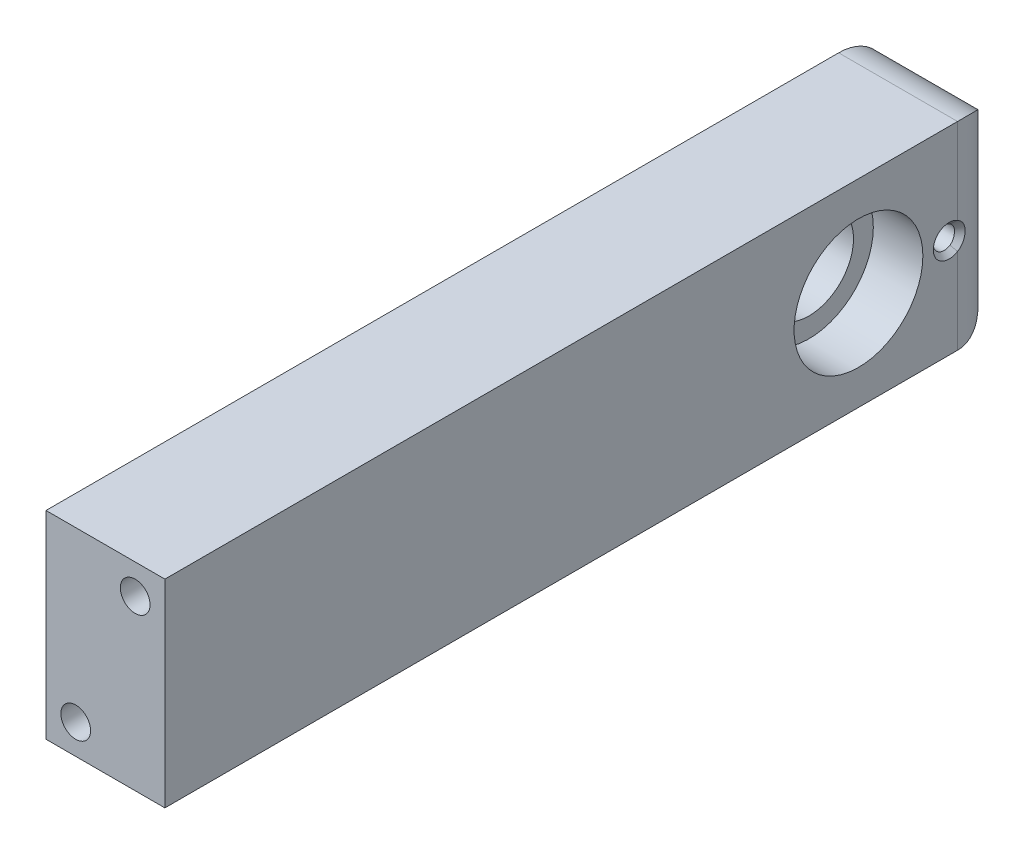
ISO-10303-21;
HEADER;
FILE_DESCRIPTION(('STEP AP214'),'2;1');
FILE_NAME('part.step','',(''),(''),'','','');
FILE_SCHEMA(('AUTOMOTIVE_DESIGN { 1 0 10303 214 1 1 1 1 }'));
ENDSEC;
DATA;
#1=APPLICATION_CONTEXT('core data for automotive mechanical design processes');
#2=APPLICATION_PROTOCOL_DEFINITION('international standard','automotive_design',2000,#1);
#3=PRODUCT_CONTEXT('',#1,'mechanical');
#4=PRODUCT('Part','Part','',(#3));
#5=PRODUCT_RELATED_PRODUCT_CATEGORY('part','',(#4));
#6=PRODUCT_DEFINITION_FORMATION('','',#4);
#7=PRODUCT_DEFINITION_CONTEXT('part definition',#1,'design');
#8=PRODUCT_DEFINITION('design','',#6,#7);
#9=PRODUCT_DEFINITION_SHAPE('','',#8);
#10=(LENGTH_UNIT() NAMED_UNIT(*) SI_UNIT(.MILLI.,.METRE.));
#11=(NAMED_UNIT(*) PLANE_ANGLE_UNIT() SI_UNIT($,.RADIAN.));
#12=(NAMED_UNIT(*) SI_UNIT($,.STERADIAN.) SOLID_ANGLE_UNIT());
#13=UNCERTAINTY_MEASURE_WITH_UNIT(LENGTH_MEASURE(1.E-05),#10,'distance_accuracy_value','');
#14=(GEOMETRIC_REPRESENTATION_CONTEXT(3) GLOBAL_UNCERTAINTY_ASSIGNED_CONTEXT((#13)) GLOBAL_UNIT_ASSIGNED_CONTEXT((#10,
#11,#12)) REPRESENTATION_CONTEXT('',''));
#15=CARTESIAN_POINT('',(0.,0.,0.));
#16=DIRECTION('',(0.,0.,1.));
#17=DIRECTION('',(1.,0.,0.));
#18=AXIS2_PLACEMENT_3D('',#15,#16,#17);
#19=CARTESIAN_POINT('',(6.,-10.,85.));
#20=DIRECTION('',(-1.,0.,0.));
#21=DIRECTION('',(0.,0.,1.));
#22=AXIS2_PLACEMENT_3D('',#19,#20,#21);
#23=PLANE('',#22);
#24=CARTESIAN_POINT('',(6.,0.,15.));
#25=DIRECTION('',(1.,0.,0.));
#26=DIRECTION('',(0.,0.,-1.));
#27=AXIS2_PLACEMENT_3D('',#24,#25,#26);
#28=CIRCLE('',#27,6.5);
#29=CARTESIAN_POINT('',(6.,0.,8.5));
#30=VERTEX_POINT('',#29);
#31=EDGE_CURVE('E142',#30,#30,#28,.T.);
#32=ORIENTED_EDGE('',*,*,#31,.F.);
#33=EDGE_LOOP('',(#32));
#34=FACE_BOUND('',#33,.T.);
#35=DIRECTION('',(0.,1.,0.));
#36=VECTOR('',#35,1.);
#37=CARTESIAN_POINT('',(6.,10.,5.));
#38=LINE('',#37,#36);
#39=CARTESIAN_POINT('',(6.,-10.,5.));
#40=VERTEX_POINT('',#39);
#41=CARTESIAN_POINT('',(6.,-1.35554417117228,5.));
#42=VERTEX_POINT('',#41);
#43=EDGE_CURVE('E162',#40,#42,#38,.T.);
#44=ORIENTED_EDGE('',*,*,#43,.T.);
#45=CARTESIAN_POINT('',(6.,0.,5.85));
#46=DIRECTION('',(-1.,0.,0.));
#47=DIRECTION('',(0.,0.,1.));
#48=AXIS2_PLACEMENT_3D('',#45,#46,#47);
#49=CIRCLE('',#48,1.59999999999974);
#50=CARTESIAN_POINT('',(6.,1.35554417117231,5.));
#51=VERTEX_POINT('',#50);
#52=EDGE_CURVE('E11',#42,#51,#49,.T.);
#53=ORIENTED_EDGE('',*,*,#52,.T.);
#54=CARTESIAN_POINT('',(6.,10.,5.));
#55=VERTEX_POINT('',#54);
#56=EDGE_CURVE('E130',#51,#55,#38,.T.);
#57=ORIENTED_EDGE('',*,*,#56,.T.);
#58=DIRECTION('',(0.,0.,-1.));
#59=VECTOR('',#58,1.);
#60=CARTESIAN_POINT('',(6.,10.,85.));
#61=LINE('',#60,#59);
#62=CARTESIAN_POINT('',(6.,10.,85.));
#63=VERTEX_POINT('',#62);
#64=EDGE_CURVE('E113',#63,#55,#61,.T.);
#65=ORIENTED_EDGE('',*,*,#64,.F.);
#66=DIRECTION('',(0.,1.,0.));
#67=VECTOR('',#66,1.);
#68=CARTESIAN_POINT('',(6.,-10.,85.));
#69=LINE('',#68,#67);
#70=CARTESIAN_POINT('',(6.,-10.,85.));
#71=VERTEX_POINT('',#70);
#72=EDGE_CURVE('E120',#71,#63,#69,.T.);
#73=ORIENTED_EDGE('',*,*,#72,.F.);
#74=DIRECTION('',(0.,0.,-1.));
#75=VECTOR('',#74,1.);
#76=CARTESIAN_POINT('',(6.,-10.,85.));
#77=LINE('',#76,#75);
#78=EDGE_CURVE('E333',#71,#40,#77,.T.);
#79=ORIENTED_EDGE('',*,*,#78,.T.);
#80=EDGE_LOOP('',(#44,#53,#57,#65,#73,#79));
#81=FACE_BOUND('',#80,.T.);
#82=ADVANCED_FACE('F39',(#34,#81),#23,.F.);
#83=CARTESIAN_POINT('',(-6.,10.,85.));
#84=DIRECTION('',(0.,-1.,0.));
#85=DIRECTION('',(0.,0.,-1.));
#86=AXIS2_PLACEMENT_3D('',#83,#84,#85);
#87=PLANE('',#86);
#88=ORIENTED_EDGE('',*,*,#64,.T.);
#89=DIRECTION('',(-1.,0.,0.));
#90=VECTOR('',#89,1.);
#91=CARTESIAN_POINT('',(-6.,10.,5.));
#92=LINE('',#91,#90);
#93=CARTESIAN_POINT('',(-6.,10.,5.));
#94=VERTEX_POINT('',#93);
#95=EDGE_CURVE('E156',#55,#94,#92,.T.);
#96=ORIENTED_EDGE('',*,*,#95,.T.);
#97=DIRECTION('',(0.,0.,-1.));
#98=VECTOR('',#97,1.);
#99=CARTESIAN_POINT('',(-6.,10.,85.));
#100=LINE('',#99,#98);
#101=CARTESIAN_POINT('',(-6.,10.,85.));
#102=VERTEX_POINT('',#101);
#103=EDGE_CURVE('E116',#102,#94,#100,.T.);
#104=ORIENTED_EDGE('',*,*,#103,.F.);
#105=DIRECTION('',(-1.,0.,0.));
#106=VECTOR('',#105,1.);
#107=CARTESIAN_POINT('',(-6.,10.,85.));
#108=LINE('',#107,#106);
#109=EDGE_CURVE('E109',#63,#102,#108,.T.);
#110=ORIENTED_EDGE('',*,*,#109,.F.);
#111=EDGE_LOOP('',(#88,#96,#104,#110));
#112=FACE_BOUND('',#111,.T.);
#113=ADVANCED_FACE('F111',(#112),#87,.F.);
#114=CARTESIAN_POINT('',(-6.,-10.,85.));
#115=DIRECTION('',(1.,0.,0.));
#116=DIRECTION('',(0.,0.,-1.));
#117=AXIS2_PLACEMENT_3D('',#114,#115,#116);
#118=PLANE('',#117);
#119=CARTESIAN_POINT('',(-6.,0.,5.85));
#120=DIRECTION('',(-1.,0.,0.));
#121=DIRECTION('',(0.,0.,1.));
#122=AXIS2_PLACEMENT_3D('',#119,#120,#121);
#123=CIRCLE('',#122,1.09999999999973);
#124=CARTESIAN_POINT('',(-6.,0.,6.94999999999973));
#125=VERTEX_POINT('',#124);
#126=EDGE_CURVE('E304',#125,#125,#123,.T.);
#127=ORIENTED_EDGE('',*,*,#126,.F.);
#128=EDGE_LOOP('',(#127));
#129=FACE_BOUND('',#128,.T.);
#130=CARTESIAN_POINT('',(-6.,0.,15.));
#131=DIRECTION('',(-1.,0.,0.));
#132=DIRECTION('',(0.,0.,1.));
#133=AXIS2_PLACEMENT_3D('',#130,#131,#132);
#134=CIRCLE('',#133,4.5);
#135=CARTESIAN_POINT('',(-6.,0.,19.5));
#136=VERTEX_POINT('',#135);
#137=EDGE_CURVE('E143',#136,#136,#134,.T.);
#138=ORIENTED_EDGE('',*,*,#137,.F.);
#139=EDGE_LOOP('',(#138));
#140=FACE_BOUND('',#139,.T.);
#141=DIRECTION('',(0.,-1.,0.));
#142=VECTOR('',#141,1.);
#143=CARTESIAN_POINT('',(-6.,-10.,0.));
#144=LINE('',#143,#142);
#145=CARTESIAN_POINT('',(-6.,5.,0.));
#146=VERTEX_POINT('',#145);
#147=CARTESIAN_POINT('',(-6.,-5.,0.));
#148=VERTEX_POINT('',#147);
#149=EDGE_CURVE('E128',#146,#148,#144,.T.);
#150=ORIENTED_EDGE('',*,*,#149,.T.);
#151=CARTESIAN_POINT('',(-6.,-5.,5.));
#152=DIRECTION('',(1.,0.,0.));
#153=DIRECTION('',(0.,0.,-1.));
#154=AXIS2_PLACEMENT_3D('',#151,#152,#153);
#155=CIRCLE('',#154,5.);
#156=CARTESIAN_POINT('',(-6.,-10.,5.));
#157=VERTEX_POINT('',#156);
#158=EDGE_CURVE('E152',#148,#157,#155,.F.);
#159=ORIENTED_EDGE('',*,*,#158,.T.);
#160=DIRECTION('',(0.,0.,-1.));
#161=VECTOR('',#160,1.);
#162=CARTESIAN_POINT('',(-6.,-10.,85.));
#163=LINE('',#162,#161);
#164=CARTESIAN_POINT('',(-6.,-10.,85.));
#165=VERTEX_POINT('',#164);
#166=EDGE_CURVE('E136',#165,#157,#163,.T.);
#167=ORIENTED_EDGE('',*,*,#166,.F.);
#168=DIRECTION('',(0.,-1.,0.));
#169=VECTOR('',#168,1.);
#170=CARTESIAN_POINT('',(-6.,-10.,85.));
#171=LINE('',#170,#169);
#172=EDGE_CURVE('E119',#102,#165,#171,.T.);
#173=ORIENTED_EDGE('',*,*,#172,.F.);
#174=ORIENTED_EDGE('',*,*,#103,.T.);
#175=CARTESIAN_POINT('',(-6.,5.,5.));
#176=DIRECTION('',(1.,0.,0.));
#177=DIRECTION('',(0.,0.,-1.));
#178=AXIS2_PLACEMENT_3D('',#175,#176,#177);
#179=CIRCLE('',#178,5.);
#180=EDGE_CURVE('E150',#94,#146,#179,.F.);
#181=ORIENTED_EDGE('',*,*,#180,.T.);
#182=EDGE_LOOP('',(#150,#159,#167,#173,#174,#181));
#183=FACE_BOUND('',#182,.T.);
#184=ADVANCED_FACE('F225',(#129,#140,#183),#118,.F.);
#185=CARTESIAN_POINT('',(-6.,-10.,85.));
#186=DIRECTION('',(0.,1.,0.));
#187=DIRECTION('',(0.,0.,1.));
#188=AXIS2_PLACEMENT_3D('',#185,#186,#187);
#189=PLANE('',#188);
#190=ORIENTED_EDGE('',*,*,#166,.T.);
#191=DIRECTION('',(1.,0.,0.));
#192=VECTOR('',#191,1.);
#193=CARTESIAN_POINT('',(6.,-10.,5.));
#194=LINE('',#193,#192);
#195=EDGE_CURVE('E131',#157,#40,#194,.T.);
#196=ORIENTED_EDGE('',*,*,#195,.T.);
#197=ORIENTED_EDGE('',*,*,#78,.F.);
#198=DIRECTION('',(1.,0.,0.));
#199=VECTOR('',#198,1.);
#200=CARTESIAN_POINT('',(-6.,-10.,85.));
#201=LINE('',#200,#199);
#202=EDGE_CURVE('E125',#165,#71,#201,.T.);
#203=ORIENTED_EDGE('',*,*,#202,.F.);
#204=EDGE_LOOP('',(#190,#196,#197,#203));
#205=FACE_BOUND('',#204,.T.);
#206=ADVANCED_FACE('F218',(#205),#189,.F.);
#207=CARTESIAN_POINT('',(0.,0.,85.));
#208=DIRECTION('',(0.,0.,-1.));
#209=DIRECTION('',(-1.,0.,0.));
#210=AXIS2_PLACEMENT_3D('',#207,#208,#209);
#211=PLANE('',#210);
#212=CARTESIAN_POINT('',(3.,7.,85.));
#213=DIRECTION('',(0.,0.,1.));
#214=DIRECTION('',(1.,0.,0.));
#215=AXIS2_PLACEMENT_3D('',#212,#213,#214);
#216=CIRCLE('',#215,1.5);
#217=CARTESIAN_POINT('',(4.5,7.,85.));
#218=VERTEX_POINT('',#217);
#219=EDGE_CURVE('E323',#218,#218,#216,.T.);
#220=ORIENTED_EDGE('',*,*,#219,.F.);
#221=EDGE_LOOP('',(#220));
#222=FACE_BOUND('',#221,.T.);
#223=CARTESIAN_POINT('',(-3.,-7.,85.));
#224=DIRECTION('',(0.,0.,1.));
#225=DIRECTION('',(1.,0.,0.));
#226=AXIS2_PLACEMENT_3D('',#223,#224,#225);
#227=CIRCLE('',#226,1.5);
#228=CARTESIAN_POINT('',(-1.5,-7.,85.));
#229=VERTEX_POINT('',#228);
#230=EDGE_CURVE('E317',#229,#229,#227,.T.);
#231=ORIENTED_EDGE('',*,*,#230,.F.);
#232=EDGE_LOOP('',(#231));
#233=FACE_BOUND('',#232,.T.);
#234=ORIENTED_EDGE('',*,*,#72,.T.);
#235=ORIENTED_EDGE('',*,*,#109,.T.);
#236=ORIENTED_EDGE('',*,*,#172,.T.);
#237=ORIENTED_EDGE('',*,*,#202,.T.);
#238=EDGE_LOOP('',(#234,#235,#236,#237));
#239=FACE_BOUND('',#238,.T.);
#240=ADVANCED_FACE('F123',(#222,#233,#239),#211,.F.);
#241=CARTESIAN_POINT('',(0.,0.,0.));
#242=DIRECTION('',(0.,0.,-1.));
#243=DIRECTION('',(-1.,0.,0.));
#244=AXIS2_PLACEMENT_3D('',#241,#242,#243);
#245=PLANE('',#244);
#246=DIRECTION('',(0.,1.,0.));
#247=VECTOR('',#246,1.);
#248=CARTESIAN_POINT('',(0.999999999999998,-10.,0.));
#249=LINE('',#248,#247);
#250=CARTESIAN_POINT('',(0.999999999999998,5.,0.));
#251=VERTEX_POINT('',#250);
#252=CARTESIAN_POINT('',(0.999999999999998,-5.,0.));
#253=VERTEX_POINT('',#252);
#254=EDGE_CURVE('E146',#251,#253,#249,.F.);
#255=ORIENTED_EDGE('',*,*,#254,.T.);
#256=DIRECTION('',(1.,0.,0.));
#257=VECTOR('',#256,1.);
#258=CARTESIAN_POINT('',(-6.,-5.,0.));
#259=LINE('',#258,#257);
#260=EDGE_CURVE('E148',#253,#148,#259,.F.);
#261=ORIENTED_EDGE('',*,*,#260,.T.);
#262=ORIENTED_EDGE('',*,*,#149,.F.);
#263=DIRECTION('',(-1.,0.,0.));
#264=VECTOR('',#263,1.);
#265=CARTESIAN_POINT('',(6.,5.,0.));
#266=LINE('',#265,#264);
#267=EDGE_CURVE('E134',#146,#251,#266,.F.);
#268=ORIENTED_EDGE('',*,*,#267,.T.);
#269=EDGE_LOOP('',(#255,#261,#262,#268));
#270=FACE_BOUND('',#269,.T.);
#271=ADVANCED_FACE('F214',(#270),#245,.T.);
#272=CARTESIAN_POINT('',(-3.,-7.,75.));
#273=DIRECTION('',(0.,0.,1.));
#274=DIRECTION('',(1.,0.,0.));
#275=AXIS2_PLACEMENT_3D('',#272,#273,#274);
#276=CYLINDRICAL_SURFACE('',#275,1.5);
#277=CARTESIAN_POINT('',(-3.,-7.,75.));
#278=DIRECTION('',(0.,0.,1.));
#279=DIRECTION('',(1.,0.,0.));
#280=AXIS2_PLACEMENT_3D('',#277,#278,#279);
#281=CIRCLE('',#280,1.5);
#282=CARTESIAN_POINT('',(-1.5,-7.,75.));
#283=VERTEX_POINT('',#282);
#284=EDGE_CURVE('E326',#283,#283,#281,.T.);
#285=ORIENTED_EDGE('',*,*,#284,.F.);
#286=EDGE_LOOP('',(#285));
#287=FACE_BOUND('',#286,.T.);
#288=ORIENTED_EDGE('',*,*,#230,.T.);
#289=EDGE_LOOP('',(#288));
#290=FACE_BOUND('',#289,.T.);
#291=ADVANCED_FACE('F210',(#287,#290),#276,.F.);
#292=CARTESIAN_POINT('',(-3.,-7.,75.));
#293=DIRECTION('',(0.,0.,1.));
#294=DIRECTION('',(1.,0.,0.));
#295=AXIS2_PLACEMENT_3D('',#292,#293,#294);
#296=PLANE('',#295);
#297=ORIENTED_EDGE('',*,*,#284,.T.);
#298=EDGE_LOOP('',(#297));
#299=FACE_BOUND('',#298,.T.);
#300=ADVANCED_FACE('F206',(#299),#296,.T.);
#301=CARTESIAN_POINT('',(3.,7.,75.));
#302=DIRECTION('',(0.,0.,1.));
#303=DIRECTION('',(1.,0.,0.));
#304=AXIS2_PLACEMENT_3D('',#301,#302,#303);
#305=CYLINDRICAL_SURFACE('',#304,1.5);
#306=CARTESIAN_POINT('',(3.,7.,75.));
#307=DIRECTION('',(0.,0.,1.));
#308=DIRECTION('',(1.,0.,0.));
#309=AXIS2_PLACEMENT_3D('',#306,#307,#308);
#310=CIRCLE('',#309,1.5);
#311=CARTESIAN_POINT('',(4.5,7.,75.));
#312=VERTEX_POINT('',#311);
#313=EDGE_CURVE('E320',#312,#312,#310,.T.);
#314=ORIENTED_EDGE('',*,*,#313,.F.);
#315=EDGE_LOOP('',(#314));
#316=FACE_BOUND('',#315,.T.);
#317=ORIENTED_EDGE('',*,*,#219,.T.);
#318=EDGE_LOOP('',(#317));
#319=FACE_BOUND('',#318,.T.);
#320=ADVANCED_FACE('F202',(#316,#319),#305,.F.);
#321=CARTESIAN_POINT('',(3.,7.,75.));
#322=DIRECTION('',(0.,0.,1.));
#323=DIRECTION('',(1.,0.,0.));
#324=AXIS2_PLACEMENT_3D('',#321,#322,#323);
#325=PLANE('',#324);
#326=ORIENTED_EDGE('',*,*,#313,.T.);
#327=EDGE_LOOP('',(#326));
#328=FACE_BOUND('',#327,.T.);
#329=ADVANCED_FACE('F198',(#328),#325,.T.);
#330=CARTESIAN_POINT('',(0.999999999999998,0.,15.));
#331=DIRECTION('',(1.,0.,0.));
#332=DIRECTION('',(0.,0.,-1.));
#333=AXIS2_PLACEMENT_3D('',#330,#331,#332);
#334=CYLINDRICAL_SURFACE('',#333,6.5);
#335=CARTESIAN_POINT('',(0.999999999999998,0.,15.));
#336=DIRECTION('',(1.,0.,0.));
#337=DIRECTION('',(0.,0.,-1.));
#338=AXIS2_PLACEMENT_3D('',#335,#336,#337);
#339=CIRCLE('',#338,6.5);
#340=CARTESIAN_POINT('',(0.999999999999998,0.,8.5));
#341=VERTEX_POINT('',#340);
#342=EDGE_CURVE('E314',#341,#341,#339,.T.);
#343=ORIENTED_EDGE('',*,*,#342,.F.);
#344=EDGE_LOOP('',(#343));
#345=FACE_BOUND('',#344,.T.);
#346=ORIENTED_EDGE('',*,*,#31,.T.);
#347=EDGE_LOOP('',(#346));
#348=FACE_BOUND('',#347,.T.);
#349=ADVANCED_FACE('F194',(#345,#348),#334,.F.);
#350=CARTESIAN_POINT('',(0.999999999999998,0.,15.));
#351=DIRECTION('',(1.,0.,0.));
#352=DIRECTION('',(0.,0.,-1.));
#353=AXIS2_PLACEMENT_3D('',#350,#351,#352);
#354=PLANE('',#353);
#355=CARTESIAN_POINT('',(0.999999999999998,0.,15.));
#356=DIRECTION('',(1.,0.,0.));
#357=DIRECTION('',(0.,0.,-1.));
#358=AXIS2_PLACEMENT_3D('',#355,#356,#357);
#359=CIRCLE('',#358,4.5);
#360=CARTESIAN_POINT('',(0.999999999999998,0.,10.5));
#361=VERTEX_POINT('',#360);
#362=EDGE_CURVE('E140',#361,#361,#359,.T.);
#363=ORIENTED_EDGE('',*,*,#362,.F.);
#364=EDGE_LOOP('',(#363));
#365=FACE_BOUND('',#364,.T.);
#366=ORIENTED_EDGE('',*,*,#342,.T.);
#367=EDGE_LOOP('',(#366));
#368=FACE_BOUND('',#367,.T.);
#369=ADVANCED_FACE('F190',(#365,#368),#354,.T.);
#370=CARTESIAN_POINT('',(6.,0.,15.));
#371=DIRECTION('',(-1.,0.,0.));
#372=DIRECTION('',(0.,0.,1.));
#373=AXIS2_PLACEMENT_3D('',#370,#371,#372);
#374=CYLINDRICAL_SURFACE('',#373,4.5);
#375=ORIENTED_EDGE('',*,*,#362,.T.);
#376=EDGE_LOOP('',(#375));
#377=FACE_BOUND('',#376,.T.);
#378=ORIENTED_EDGE('',*,*,#137,.T.);
#379=EDGE_LOOP('',(#378));
#380=FACE_BOUND('',#379,.T.);
#381=ADVANCED_FACE('F186',(#377,#380),#374,.F.);
#382=CARTESIAN_POINT('',(-6.,5.,5.));
#383=DIRECTION('',(1.,0.,0.));
#384=DIRECTION('',(0.,0.,-1.));
#385=AXIS2_PLACEMENT_3D('',#382,#383,#384);
#386=CYLINDRICAL_SURFACE('',#385,5.);
#387=ORIENTED_EDGE('',*,*,#180,.F.);
#388=ORIENTED_EDGE('',*,*,#95,.F.);
#389=CARTESIAN_POINT('',(0.999999999999998,5.,5.));
#390=DIRECTION('',(0.707106781186547,-0.707106781186547,0.));
#391=DIRECTION('',(0.707106781186547,0.707106781186547,0.));
#392=AXIS2_PLACEMENT_3D('',#389,#390,#391);
#393=ELLIPSE('',#392,7.07106781186547,5.);
#394=EDGE_CURVE('E310',#251,#55,#393,.T.);
#395=ORIENTED_EDGE('',*,*,#394,.F.);
#396=ORIENTED_EDGE('',*,*,#267,.F.);
#397=EDGE_LOOP('',(#387,#388,#395,#396));
#398=FACE_BOUND('',#397,.T.);
#399=ADVANCED_FACE('F189',(#398),#386,.T.);
#400=CARTESIAN_POINT('',(0.999999999999998,-10.,5.));
#401=DIRECTION('',(0.,-1.,0.));
#402=DIRECTION('',(0.,0.,-1.));
#403=AXIS2_PLACEMENT_3D('',#400,#401,#402);
#404=CYLINDRICAL_SURFACE('',#403,5.);
#405=ORIENTED_EDGE('',*,*,#56,.F.);
#406=CARTESIAN_POINT('',(6.,-1.35554417117228,5.00000000000001));
#407=CARTESIAN_POINT('',(5.99999887546876,-1.31935419357018,4.93588151537443));
#408=CARTESIAN_POINT('',(5.99877171760392,-1.27992329824546,4.87506133053739));
#409=CARTESIAN_POINT('',(5.99561083909648,-1.21610701320761,4.78856333170941));
#410=CARTESIAN_POINT('',(5.99433627601306,-1.19405479132877,4.76052122431837));
#411=CARTESIAN_POINT('',(5.99142414366557,-1.1483945367328,4.70601008795976));
#412=CARTESIAN_POINT('',(5.98978641608421,-1.12478654040462,4.67954102986061));
#413=CARTESIAN_POINT('',(5.98622278073417,-1.07600034352984,4.62818698240978));
#414=CARTESIAN_POINT('',(5.98429595236251,-1.05081190202665,4.60329471001046));
#415=CARTESIAN_POINT('',(5.98023069438661,-0.998871917398047,4.55515392125045));
#416=CARTESIAN_POINT('',(5.97808207806446,-0.97199450267686,4.53181416387674));
#417=CARTESIAN_POINT('',(5.9737110398759,-0.917429886432049,4.48746480661742));
#418=CARTESIAN_POINT('',(5.97147826579394,-0.889608136527665,4.46632158915809));
#419=CARTESIAN_POINT('',(5.96699925330906,-0.832977706869429,4.42612949441239));
#420=CARTESIAN_POINT('',(5.96475189697835,-0.804156437190698,4.40706830441694));
#421=CARTESIAN_POINT('',(5.9580909100551,-0.716181202913144,4.35296297677382));
#422=CARTESIAN_POINT('',(5.95375918012261,-0.655506513210227,4.32098796743099));
#423=CARTESIAN_POINT('',(5.94780411359106,-0.561440737557803,4.27928344497277));
#424=CARTESIAN_POINT('',(5.94590483238953,-0.529466180291179,4.26640176063086));
#425=CARTESIAN_POINT('',(5.94237091578252,-0.464930320411764,4.24295987674977));
#426=CARTESIAN_POINT('',(5.94074417096145,-0.432525332089706,4.23244764723167));
#427=CARTESIAN_POINT('',(5.93780218561286,-0.367314811791007,4.21374352250243));
#428=CARTESIAN_POINT('',(5.93648805547647,-0.334531503289964,4.20555909087693));
#429=CARTESIAN_POINT('',(5.93420525548111,-0.268611562563158,4.1915018706636));
#430=CARTESIAN_POINT('',(5.93323652992647,-0.235474919636769,4.18562916293615));
#431=CARTESIAN_POINT('',(5.93088782392722,-0.135533118507153,4.17148489569106));
#432=CARTESIAN_POINT('',(5.93006750051785,-0.0682275554746119,4.16667267049615));
#433=CARTESIAN_POINT('',(5.93006547318689,0.0679749888351969,4.16666067391239));
#434=CARTESIAN_POINT('',(5.93088528548876,0.135373087888064,4.17146990728449));
#435=CARTESIAN_POINT('',(5.93323208066654,0.235311515249672,4.18560222151105));
#436=CARTESIAN_POINT('',(5.93419998106964,0.268439554816096,4.19146975484492));
#437=CARTESIAN_POINT('',(5.93648028460049,0.334326693305265,4.20551087755209));
#438=CARTESIAN_POINT('',(5.93779274158944,0.367086005473655,4.21368440480746));
#439=CARTESIAN_POINT('',(5.94073014501523,0.432233761469351,4.23235755881328));
#440=CARTESIAN_POINT('',(5.94235528324704,0.464621958798522,4.24285856352954));
#441=CARTESIAN_POINT('',(5.94587925888794,0.529021824853631,4.26622975574313));
#442=CARTESIAN_POINT('',(5.94778304675036,0.561088179081947,4.27913884058593));
#443=CARTESIAN_POINT('',(5.95175401728336,0.623852566736355,4.30694252037483));
#444=CARTESIAN_POINT('',(5.95383140759102,0.654745402420917,4.32190386885589));
#445=CARTESIAN_POINT('',(5.95810146521845,0.715454972413842,4.35386551492998));
#446=CARTESIAN_POINT('',(5.96029528923699,0.745291680700241,4.37087290392672));
#447=CARTESIAN_POINT('',(5.96695508887587,0.833263035458151,4.42495552510601));
#448=CARTESIAN_POINT('',(5.97150255996019,0.8898641920768,4.46508693301575));
#449=CARTESIAN_POINT('',(5.9769623973196,0.958016471767514,4.52044628459099));
#450=CARTESIAN_POINT('',(5.97804269536191,0.971515886234897,4.53178384920035));
#451=CARTESIAN_POINT('',(5.98017052902915,0.998251670288542,4.55498596209424));
#452=CARTESIAN_POINT('',(5.98121831064939,1.01149286447863,4.56685898319495));
#453=CARTESIAN_POINT('',(5.98427530472768,1.05054297456702,4.60303122700905));
#454=CARTESIAN_POINT('',(5.98620502166585,1.07576371169769,4.62794674963142));
#455=CARTESIAN_POINT('',(5.98977511624149,1.12462540953108,4.67936263539093));
#456=CARTESIAN_POINT('',(5.99141546415606,1.148264754939,4.70586037876757));
#457=CARTESIAN_POINT('',(5.99433169334122,1.19397666069143,4.76042274260202));
#458=CARTESIAN_POINT('',(5.99560773185176,1.21604917499952,4.78848740158613));
#459=CARTESIAN_POINT('',(5.99877164831428,1.27991213185126,4.87504127230071));
#460=CARTESIAN_POINT('',(5.99999890395832,1.31935513770023,4.93588314242297));
#461=CARTESIAN_POINT('',(6.,1.35554417117231,5.));
#462=B_SPLINE_CURVE_WITH_KNOTS('',3,(#406,#407,#408,#409,#410,#411,#412,#413,#414,#415,#416,
#417,#418,#419,#420,#421,#422,#423,#424,#425,#426,#427,#428,#429,#430,#431,#432,#433,#434,#435,
#436,#437,#438,#439,#440,#441,#442,#443,#444,#445,#446,#447,#448,#449,#450,#451,#452,#453,#454,
#455,#456,#457,#458,#459,#460,#461),.UNSPECIFIED.,.F.,.F.,(4,2,2,2,2,2,2,2,2,2,2,2,2,2,2,2,2,2,
2,2,2,2,2,2,2,2,2,4),(0.,0.000201370254846935,0.000302055382270403,0.00040274050969387,
0.000503425637117338,0.000604110764540805,0.000704795891964273,0.00080548101938774,
0.00100685127423468,0.00110753640165814,0.00120822152908161,0.00130890665650508,
0.00140959178392855,0.00161096203877548,0.00181233229362242,0.00191301742104588,
0.00201370254846935,0.00211438767589282,0.00221507280331629,0.00231575793073975,
0.00241644305816322,0.00261781331301016,0.00266815587672189,0.00271849844043362,
0.00281918356785709,0.00291986869528056,0.00302055382270403,0.00322192407755096),.UNSPECIFIED.);
#463=EDGE_CURVE('E50',#51,#42,#462,.F.);
#464=ORIENTED_EDGE('',*,*,#463,.T.);
#465=ORIENTED_EDGE('',*,*,#43,.F.);
#466=CARTESIAN_POINT('',(0.999999999999998,-5.,5.));
#467=DIRECTION('',(-0.707106781186547,-0.707106781186547,0.));
#468=DIRECTION('',(0.707106781186547,-0.707106781186547,0.));
#469=AXIS2_PLACEMENT_3D('',#466,#467,#468);
#470=ELLIPSE('',#469,7.07106781186547,5.);
#471=EDGE_CURVE('E306',#253,#40,#470,.T.);
#472=ORIENTED_EDGE('',*,*,#471,.F.);
#473=ORIENTED_EDGE('',*,*,#254,.F.);
#474=ORIENTED_EDGE('',*,*,#394,.T.);
#475=EDGE_LOOP('',(#405,#464,#465,#472,#473,#474));
#476=FACE_BOUND('',#475,.T.);
#477=ADVANCED_FACE('F237',(#476),#404,.T.);
#478=CARTESIAN_POINT('',(-6.,-5.,5.));
#479=DIRECTION('',(-1.,0.,0.));
#480=DIRECTION('',(0.,0.,1.));
#481=AXIS2_PLACEMENT_3D('',#478,#479,#480);
#482=CYLINDRICAL_SURFACE('',#481,5.);
#483=ORIENTED_EDGE('',*,*,#158,.F.);
#484=ORIENTED_EDGE('',*,*,#260,.F.);
#485=ORIENTED_EDGE('',*,*,#471,.T.);
#486=ORIENTED_EDGE('',*,*,#195,.F.);
#487=EDGE_LOOP('',(#483,#484,#485,#486));
#488=FACE_BOUND('',#487,.T.);
#489=ADVANCED_FACE('F184',(#488),#482,.T.);
#490=CARTESIAN_POINT('',(8.,0.,5.85));
#491=DIRECTION('',(-1.,0.,0.));
#492=DIRECTION('',(0.,0.,1.));
#493=AXIS2_PLACEMENT_3D('',#490,#491,#492);
#494=CYLINDRICAL_SURFACE('',#493,1.09999999999973);
#495=CARTESIAN_POINT('',(5.49999999999999,0.,5.85));
#496=DIRECTION('',(-1.,0.,0.));
#497=DIRECTION('',(0.,0.,1.));
#498=AXIS2_PLACEMENT_3D('',#495,#496,#497);
#499=CIRCLE('',#498,1.09999999999973);
#500=CARTESIAN_POINT('',(5.49999999999999,0.931936617680891,5.26562500000005));
#501=VERTEX_POINT('',#500);
#502=CARTESIAN_POINT('',(5.49999999999999,-0.931936617680864,5.26562500000005));
#503=VERTEX_POINT('',#502);
#504=EDGE_CURVE('E166',#501,#503,#499,.F.);
#505=ORIENTED_EDGE('',*,*,#504,.T.);
#506=CARTESIAN_POINT('',(5.49999999999999,0.931936617680891,5.26562500000005));
#507=CARTESIAN_POINT('',(5.49999901356248,0.907056657168843,5.22595269437426));
#508=CARTESIAN_POINT('',(5.49889448348301,0.879939590650274,5.18830678723929));
#509=CARTESIAN_POINT('',(5.49604695866649,0.836033807810803,5.13475157972989));
#510=CARTESIAN_POINT('',(5.49489852400708,0.820858954225306,5.11738657198507));
#511=CARTESIAN_POINT('',(5.49227391774044,0.789432019020488,5.08362610936248));
#512=CARTESIAN_POINT('',(5.49079760461733,0.773179969052559,5.0672306306482));
#513=CARTESIAN_POINT('',(5.48758451949926,0.739587551792109,5.03541705133451));
#514=CARTESIAN_POINT('',(5.4858477742549,0.722248295014703,5.02000057171186));
#515=CARTESIAN_POINT('',(5.48309647958444,0.695401344329042,4.99761899585197));
#516=CARTESIAN_POINT('',(5.48215347612622,0.686298023323306,4.99027256404587));
#517=CARTESIAN_POINT('',(5.48023842582571,0.667917171786459,4.9759162566928));
#518=CARTESIAN_POINT('',(5.47926615758748,0.658636324338681,4.9689011385897));
#519=CARTESIAN_POINT('',(5.47435230396476,0.611781632058499,4.93464753980778));
#520=CARTESIAN_POINT('',(5.47025957998787,0.572868336873392,4.90981623115718));
#521=CARTESIAN_POINT('',(5.46426576031348,0.5123880304834,4.87635260930585));
#522=CARTESIAN_POINT('',(5.46229131869659,0.491875293534412,4.86582928736297));
#523=CARTESIAN_POINT('',(5.45844826683191,0.450137464164417,4.8460530188547));
#524=CARTESIAN_POINT('',(5.45657861555479,0.428898639628602,4.83679568448097));
#525=CARTESIAN_POINT('',(5.45300474207553,0.385748123121425,4.81959215761367));
#526=CARTESIAN_POINT('',(5.451291332999,0.363702504584997,4.81160466136554));
#527=CARTESIAN_POINT('',(5.44811975492246,0.319427596675814,4.79714373618459));
#528=CARTESIAN_POINT('',(5.44665713051369,0.29716071101007,4.79064623951578));
#529=CARTESIAN_POINT('',(5.44401346743049,0.25237162876321,4.77909222547472));
#530=CARTESIAN_POINT('',(5.44283225614042,0.229849601647261,4.77403485548543));
#531=CARTESIAN_POINT('',(5.44077998296267,0.18455219393615,4.7653469108104));
#532=CARTESIAN_POINT('',(5.43990887259974,0.16177666672964,4.76171637455948));
#533=CARTESIAN_POINT('',(5.43779675694015,0.0930689979320438,4.75297200513351));
#534=CARTESIAN_POINT('',(5.43705892586819,0.0467328048081385,4.74999629198338));
#535=CARTESIAN_POINT('',(5.43706075046605,-0.0469064443727282,4.75000371486958));
#536=CARTESIAN_POINT('',(5.43779904153477,-0.0931790189830479,4.75298127921013));
#537=CARTESIAN_POINT('',(5.43991287693366,-0.161889007245565,4.76173304456623));
#538=CARTESIAN_POINT('',(5.44078472993299,-0.184670449262246,4.76536678247321));
#539=CARTESIAN_POINT('',(5.4428392499288,-0.229990408511732,4.77406468748017));
#540=CARTESIAN_POINT('',(5.44402196705157,-0.252528933106382,4.77912880454849));
#541=CARTESIAN_POINT('',(5.44666975386529,-0.297361165811554,4.79070198172466));
#542=CARTESIAN_POINT('',(5.44813382420427,-0.319639595283215,4.79720642373906));
#543=CARTESIAN_POINT('',(5.45131434915055,-0.364007998949995,4.81171108939038));
#544=CARTESIAN_POINT('',(5.45302370223277,-0.385990507080896,4.81968163158095));
#545=CARTESIAN_POINT('',(5.45838326210869,-0.450660727812106,4.84548630484007));
#546=CARTESIAN_POINT('',(5.46228181904997,-0.492374577006715,4.86527084188108));
#547=CARTESIAN_POINT('',(5.46827670728031,-0.55285755056657,4.89874851335696));
#548=CARTESIAN_POINT('',(5.47029932797814,-0.572672173472706,4.91054262466776));
#549=CARTESIAN_POINT('',(5.47433043921453,-0.611605593862691,4.93541148329162));
#550=CARTESIAN_POINT('',(5.4763399358884,-0.630733046922948,4.94849384909531));
#551=CARTESIAN_POINT('',(5.4802738702579,-0.668246220589313,4.97593501389809));
#552=CARTESIAN_POINT('',(5.48220762494798,-0.68672444321148,4.99037648877411));
#553=CARTESIAN_POINT('',(5.48586635712621,-0.722433182642878,5.02016360181872));
#554=CARTESIAN_POINT('',(5.48760050266074,-0.7397502361767,5.03556569536612));
#555=CARTESIAN_POINT('',(5.49080777447578,-0.773290746528108,5.06734101222631));
#556=CARTESIAN_POINT('',(5.492281729299,-0.789521244003718,5.08371874192515));
#557=CARTESIAN_POINT('',(5.49490264841174,-0.820912669038475,5.11744750754707));
#558=CARTESIAN_POINT('',(5.49604975518674,-0.836073571578825,5.13479856149362));
#559=CARTESIAN_POINT('',(5.49889454584369,-0.879947267546352,5.18831919827332));
#560=CARTESIAN_POINT('',(5.49999898792187,-0.907056008079426,5.22595168763798));
#561=CARTESIAN_POINT('',(5.49999999999999,-0.931936617680864,5.26562500000005));
#562=B_SPLINE_CURVE_WITH_KNOTS('',3,(#506,#507,#508,#509,#510,#511,#512,#513,#514,#515,#516,
#517,#518,#519,#520,#521,#522,#523,#524,#525,#526,#527,#528,#529,#530,#531,#532,#533,#534,#535,
#536,#537,#538,#539,#540,#541,#542,#543,#544,#545,#546,#547,#548,#549,#550,#551,#552,#553,#554,
#555,#556,#557,#558,#559,#560,#561),.UNSPECIFIED.,.F.,.F.,(4,2,2,2,2,2,2,2,2,2,2,2,2,2,2,2,2,2,
2,2,2,2,2,2,2,2,2,4),(0.,0.000201370254846935,0.000302055382270403,0.00040274050969387,
0.000503425637117337,0.000553768200829071,0.000604110764540805,0.00080548101938774,
0.000906166146811207,0.00100685127423467,0.00110753640165814,0.00120822152908161,
0.00130890665650508,0.00140959178392855,0.00161096203877548,0.00181233229362242,
0.00191301742104588,0.00201370254846935,0.00211438767589282,0.00221507280331629,
0.00241644305816322,0.00251712818558669,0.00261781331301016,0.00271849844043362,
0.00281918356785709,0.00291986869528056,0.00302055382270403,0.00322192407755096),.UNSPECIFIED.);
#563=EDGE_CURVE('E168',#503,#501,#562,.F.);
#564=ORIENTED_EDGE('',*,*,#563,.T.);
#565=EDGE_LOOP('',(#505,#564));
#566=FACE_BOUND('',#565,.T.);
#567=ORIENTED_EDGE('',*,*,#126,.T.);
#568=EDGE_LOOP('',(#567));
#569=FACE_BOUND('',#568,.T.);
#570=ADVANCED_FACE('F175',(#566,#569),#494,.F.);
#571=CARTESIAN_POINT('',(6.,0.,5.85));
#572=DIRECTION('',(1.,0.,0.));
#573=DIRECTION('',(0.,0.,-1.));
#574=AXIS2_PLACEMENT_3D('',#571,#572,#573);
#575=CONICAL_SURFACE('',#574,1.59999999999974,0.785398163397445);
#576=CARTESIAN_POINT('',(6.,1.35554417117231,5.));
#577=CARTESIAN_POINT('',(5.49999999999999,0.931936617680891,5.26562500000005));
#578=B_SPLINE_CURVE_WITH_KNOTS('',1,(#576,#577),.UNSPECIFIED.,.F.,.F.,(2,2),(0.,1.),.UNSPECIFIED.);
#579=EDGE_CURVE('E257',#51,#501,#578,.T.);
#580=ORIENTED_EDGE('',*,*,#579,.F.);
#581=ORIENTED_EDGE('',*,*,#52,.F.);
#582=CARTESIAN_POINT('',(5.49999999999999,-0.931936617680864,5.26562500000005));
#583=CARTESIAN_POINT('',(6.,-1.35554417117228,5.00000000000001));
#584=B_SPLINE_CURVE_WITH_KNOTS('',1,(#582,#583),.UNSPECIFIED.,.F.,.F.,(2,2),(0.,1.),.UNSPECIFIED.);
#585=EDGE_CURVE('E64',#503,#42,#584,.T.);
#586=ORIENTED_EDGE('',*,*,#585,.F.);
#587=ORIENTED_EDGE('',*,*,#504,.F.);
#588=EDGE_LOOP('',(#580,#581,#586,#587));
#589=FACE_BOUND('',#588,.T.);
#590=ADVANCED_FACE('F41',(#589),#575,.F.);
#591=CARTESIAN_POINT('',(5.49999999999999,-0.931936617680864,5.26562500000005));
#592=CARTESIAN_POINT('',(5.49999898792187,-0.907056008079426,5.22595168763798));
#593=CARTESIAN_POINT('',(5.49889454584369,-0.879947267546352,5.18831919827332));
#594=CARTESIAN_POINT('',(5.49604975518674,-0.836073571578825,5.13479856149362));
#595=CARTESIAN_POINT('',(5.49490264841174,-0.820912669038475,5.11744750754707));
#596=CARTESIAN_POINT('',(5.492281729299,-0.789521244003718,5.08371874192515));
#597=CARTESIAN_POINT('',(5.49080777447578,-0.773290746528108,5.06734101222631));
#598=CARTESIAN_POINT('',(5.48760050266074,-0.7397502361767,5.03556569536612));
#599=CARTESIAN_POINT('',(5.48586635712621,-0.722433182642878,5.02016360181872));
#600=CARTESIAN_POINT('',(5.48220762494798,-0.68672444321148,4.99037648877411));
#601=CARTESIAN_POINT('',(5.4802738702579,-0.668246220589313,4.97593501389809));
#602=CARTESIAN_POINT('',(5.4763399358884,-0.630733046922948,4.94849384909531));
#603=CARTESIAN_POINT('',(5.47433043921453,-0.611605593862691,4.93541148329162));
#604=CARTESIAN_POINT('',(5.47029932797814,-0.572672173472706,4.91054262466776));
#605=CARTESIAN_POINT('',(5.46827670728031,-0.55285755056657,4.89874851335696));
#606=CARTESIAN_POINT('',(5.46228181904997,-0.492374577006715,4.86527084188108));
#607=CARTESIAN_POINT('',(5.45838326210869,-0.450660727812106,4.84548630484007));
#608=CARTESIAN_POINT('',(5.45302370223277,-0.385990507080896,4.81968163158095));
#609=CARTESIAN_POINT('',(5.45131434915055,-0.364007998949995,4.81171108939038));
#610=CARTESIAN_POINT('',(5.44813382420427,-0.319639595283215,4.79720642373906));
#611=CARTESIAN_POINT('',(5.44666975386529,-0.297361165811554,4.79070198172466));
#612=CARTESIAN_POINT('',(5.44402196705157,-0.252528933106382,4.77912880454849));
#613=CARTESIAN_POINT('',(5.4428392499288,-0.229990408511732,4.77406468748017));
#614=CARTESIAN_POINT('',(5.44078472993299,-0.184670449262246,4.76536678247321));
#615=CARTESIAN_POINT('',(5.43991287693366,-0.161889007245565,4.76173304456623));
#616=CARTESIAN_POINT('',(5.43779904153477,-0.0931790189830479,4.75298127921013));
#617=CARTESIAN_POINT('',(5.43706075046605,-0.0469064443727282,4.75000371486958));
#618=CARTESIAN_POINT('',(5.43705892586819,0.0467328048081385,4.74999629198338));
#619=CARTESIAN_POINT('',(5.43779675694015,0.0930689979320438,4.75297200513351));
#620=CARTESIAN_POINT('',(5.43990887259974,0.16177666672964,4.76171637455948));
#621=CARTESIAN_POINT('',(5.44077998296267,0.18455219393615,4.7653469108104));
#622=CARTESIAN_POINT('',(5.44283225614042,0.229849601647261,4.77403485548543));
#623=CARTESIAN_POINT('',(5.44401346743049,0.25237162876321,4.77909222547472));
#624=CARTESIAN_POINT('',(5.44665713051369,0.29716071101007,4.79064623951578));
#625=CARTESIAN_POINT('',(5.44811975492246,0.319427596675814,4.79714373618459));
#626=CARTESIAN_POINT('',(5.451291332999,0.363702504584997,4.81160466136554));
#627=CARTESIAN_POINT('',(5.45300474207553,0.385748123121425,4.81959215761367));
#628=CARTESIAN_POINT('',(5.45657861555479,0.428898639628602,4.83679568448097));
#629=CARTESIAN_POINT('',(5.45844826683191,0.450137464164417,4.8460530188547));
#630=CARTESIAN_POINT('',(5.46229131869659,0.491875293534412,4.86582928736297));
#631=CARTESIAN_POINT('',(5.46426576031348,0.5123880304834,4.87635260930585));
#632=CARTESIAN_POINT('',(5.47025957998787,0.572868336873392,4.90981623115718));
#633=CARTESIAN_POINT('',(5.47435230396476,0.611781632058499,4.93464753980778));
#634=CARTESIAN_POINT('',(5.47926615758748,0.658636324338681,4.9689011385897));
#635=CARTESIAN_POINT('',(5.48023842582571,0.667917171786459,4.9759162566928));
#636=CARTESIAN_POINT('',(5.48215347612622,0.686298023323306,4.99027256404587));
#637=CARTESIAN_POINT('',(5.48309647958444,0.695401344329042,4.99761899585197));
#638=CARTESIAN_POINT('',(5.4858477742549,0.722248295014703,5.02000057171186));
#639=CARTESIAN_POINT('',(5.48758451949926,0.739587551792109,5.03541705133451));
#640=CARTESIAN_POINT('',(5.49079760461733,0.773179969052559,5.0672306306482));
#641=CARTESIAN_POINT('',(5.49227391774044,0.789432019020488,5.08362610936248));
#642=CARTESIAN_POINT('',(5.49489852400708,0.820858954225306,5.11738657198507));
#643=CARTESIAN_POINT('',(5.49604695866649,0.836033807810803,5.13475157972989));
#644=CARTESIAN_POINT('',(5.49889448348301,0.879939590650274,5.18830678723929));
#645=CARTESIAN_POINT('',(5.49999901356248,0.907056657168843,5.22595269437426));
#646=CARTESIAN_POINT('',(5.49999999999999,0.931936617680891,5.26562500000005));
#647=CARTESIAN_POINT('',(6.,-1.35554417117228,5.00000000000001));
#648=CARTESIAN_POINT('',(5.99999887546876,-1.31935419357018,4.93588151537443));
#649=CARTESIAN_POINT('',(5.99877171760392,-1.27992329824546,4.87506133053739));
#650=CARTESIAN_POINT('',(5.99561083909648,-1.21610701320761,4.78856333170941));
#651=CARTESIAN_POINT('',(5.99433627601306,-1.19405479132877,4.76052122431837));
#652=CARTESIAN_POINT('',(5.99142414366557,-1.1483945367328,4.70601008795976));
#653=CARTESIAN_POINT('',(5.98978641608421,-1.12478654040462,4.67954102986061));
#654=CARTESIAN_POINT('',(5.98622278073417,-1.07600034352984,4.62818698240978));
#655=CARTESIAN_POINT('',(5.98429595236251,-1.05081190202665,4.60329471001046));
#656=CARTESIAN_POINT('',(5.98023069438661,-0.998871917398047,4.55515392125045));
#657=CARTESIAN_POINT('',(5.97808207806446,-0.97199450267686,4.53181416387674));
#658=CARTESIAN_POINT('',(5.9737110398759,-0.917429886432049,4.48746480661742));
#659=CARTESIAN_POINT('',(5.97147826579394,-0.889608136527665,4.46632158915809));
#660=CARTESIAN_POINT('',(5.96699925330906,-0.832977706869429,4.42612949441239));
#661=CARTESIAN_POINT('',(5.96475189697835,-0.804156437190698,4.40706830441694));
#662=CARTESIAN_POINT('',(5.9580909100551,-0.716181202913144,4.35296297677382));
#663=CARTESIAN_POINT('',(5.95375918012261,-0.655506513210227,4.32098796743099));
#664=CARTESIAN_POINT('',(5.94780411359106,-0.561440737557803,4.27928344497277));
#665=CARTESIAN_POINT('',(5.94590483238953,-0.529466180291179,4.26640176063086));
#666=CARTESIAN_POINT('',(5.94237091578252,-0.464930320411764,4.24295987674977));
#667=CARTESIAN_POINT('',(5.94074417096145,-0.432525332089706,4.23244764723167));
#668=CARTESIAN_POINT('',(5.93780218561286,-0.367314811791007,4.21374352250243));
#669=CARTESIAN_POINT('',(5.93648805547647,-0.334531503289964,4.20555909087693));
#670=CARTESIAN_POINT('',(5.93420525548111,-0.268611562563158,4.1915018706636));
#671=CARTESIAN_POINT('',(5.93323652992647,-0.235474919636769,4.18562916293615));
#672=CARTESIAN_POINT('',(5.93088782392722,-0.135533118507153,4.17148489569106));
#673=CARTESIAN_POINT('',(5.93006750051785,-0.0682275554746119,4.16667267049615));
#674=CARTESIAN_POINT('',(5.93006547318689,0.0679749888351969,4.16666067391239));
#675=CARTESIAN_POINT('',(5.93088528548876,0.135373087888064,4.17146990728449));
#676=CARTESIAN_POINT('',(5.93323208066654,0.235311515249672,4.18560222151105));
#677=CARTESIAN_POINT('',(5.93419998106964,0.268439554816096,4.19146975484492));
#678=CARTESIAN_POINT('',(5.93648028460049,0.334326693305265,4.20551087755209));
#679=CARTESIAN_POINT('',(5.93779274158944,0.367086005473655,4.21368440480746));
#680=CARTESIAN_POINT('',(5.94073014501523,0.432233761469351,4.23235755881328));
#681=CARTESIAN_POINT('',(5.94235528324704,0.464621958798522,4.24285856352954));
#682=CARTESIAN_POINT('',(5.94587925888794,0.529021824853631,4.26622975574313));
#683=CARTESIAN_POINT('',(5.94778304675036,0.561088179081947,4.27913884058593));
#684=CARTESIAN_POINT('',(5.95175401728336,0.623852566736355,4.30694252037483));
#685=CARTESIAN_POINT('',(5.95383140759102,0.654745402420917,4.32190386885589));
#686=CARTESIAN_POINT('',(5.95810146521845,0.715454972413842,4.35386551492998));
#687=CARTESIAN_POINT('',(5.96029528923699,0.745291680700241,4.37087290392672));
#688=CARTESIAN_POINT('',(5.96695508887587,0.833263035458151,4.42495552510601));
#689=CARTESIAN_POINT('',(5.97150255996019,0.8898641920768,4.46508693301575));
#690=CARTESIAN_POINT('',(5.9769623973196,0.958016471767514,4.52044628459099));
#691=CARTESIAN_POINT('',(5.97804269536191,0.971515886234897,4.53178384920035));
#692=CARTESIAN_POINT('',(5.98017052902915,0.998251670288542,4.55498596209424));
#693=CARTESIAN_POINT('',(5.98121831064939,1.01149286447863,4.56685898319495));
#694=CARTESIAN_POINT('',(5.98427530472768,1.05054297456702,4.60303122700905));
#695=CARTESIAN_POINT('',(5.98620502166585,1.07576371169769,4.62794674963142));
#696=CARTESIAN_POINT('',(5.98977511624149,1.12462540953108,4.67936263539093));
#697=CARTESIAN_POINT('',(5.99141546415606,1.148264754939,4.70586037876757));
#698=CARTESIAN_POINT('',(5.99433169334122,1.19397666069143,4.76042274260202));
#699=CARTESIAN_POINT('',(5.99560773185176,1.21604917499952,4.78848740158613));
#700=CARTESIAN_POINT('',(5.99877164831428,1.27991213185126,4.87504127230071));
#701=CARTESIAN_POINT('',(5.99999890395832,1.31935513770023,4.93588314242297));
#702=CARTESIAN_POINT('',(6.,1.35554417117231,5.));
#703=B_SPLINE_SURFACE_WITH_KNOTS('',1,3,((#591,#592,#593,#594,#595,#596,#597,#598,#599,#600,
#601,#602,#603,#604,#605,#606,#607,#608,#609,#610,#611,#612,#613,#614,#615,#616,#617,#618,#619,
#620,#621,#622,#623,#624,#625,#626,#627,#628,#629,#630,#631,#632,#633,#634,#635,#636,#637,#638,
#639,#640,#641,#642,#643,#644,#645,#646),(#647,#648,#649,#650,#651,#652,#653,#654,#655,#656,
#657,#658,#659,#660,#661,#662,#663,#664,#665,#666,#667,#668,#669,#670,#671,#672,#673,#674,#675,
#676,#677,#678,#679,#680,#681,#682,#683,#684,#685,#686,#687,#688,#689,#690,#691,#692,#693,#694,
#695,#696,#697,#698,#699,#700,#701,#702)),.UNSPECIFIED.,.F.,.F.,.F.,(2,2),(4,2,2,2,2,2,2,2,2,2,
2,2,2,2,2,2,2,2,2,2,2,2,2,2,2,2,2,4),(0.,1.),(0.,0.000201370254846935,0.000302055382270403,
0.00040274050969387,0.000503425637117338,0.000604110764540805,0.000704795891964273,
0.00080548101938774,0.00100685127423468,0.00110753640165814,0.00120822152908161,
0.00130890665650508,0.00140959178392855,0.00161096203877548,0.00181233229362242,
0.00191301742104588,0.00201370254846935,0.00211438767589282,0.00221507280331629,
0.00231575793073975,0.00241644305816322,0.00261781331301016,0.00266815587672189,
0.00271849844043362,0.00281918356785709,0.00291986869528056,0.00302055382270403,
0.00322192407755096),.UNSPECIFIED.);
#704=ORIENTED_EDGE('',*,*,#585,.T.);
#705=ORIENTED_EDGE('',*,*,#463,.F.);
#706=ORIENTED_EDGE('',*,*,#579,.T.);
#707=ORIENTED_EDGE('',*,*,#563,.F.);
#708=EDGE_LOOP('',(#704,#705,#706,#707));
#709=FACE_BOUND('',#708,.T.);
#710=ADVANCED_FACE('F263',(#709),#703,.T.);
#711=CLOSED_SHELL('',(#82,#113,#184,#206,#240,#271,#291,#300,#320,#329,#349,#369,#381,#399,#477,
#489,#570,#590,#710));
#712=MANIFOLD_SOLID_BREP('B2',#711);
#713=ADVANCED_BREP_SHAPE_REPRESENTATION('',(#18,#712),#14);
#714=SHAPE_DEFINITION_REPRESENTATION(#9,#713);
ENDSEC;
END-ISO-10303-21;
